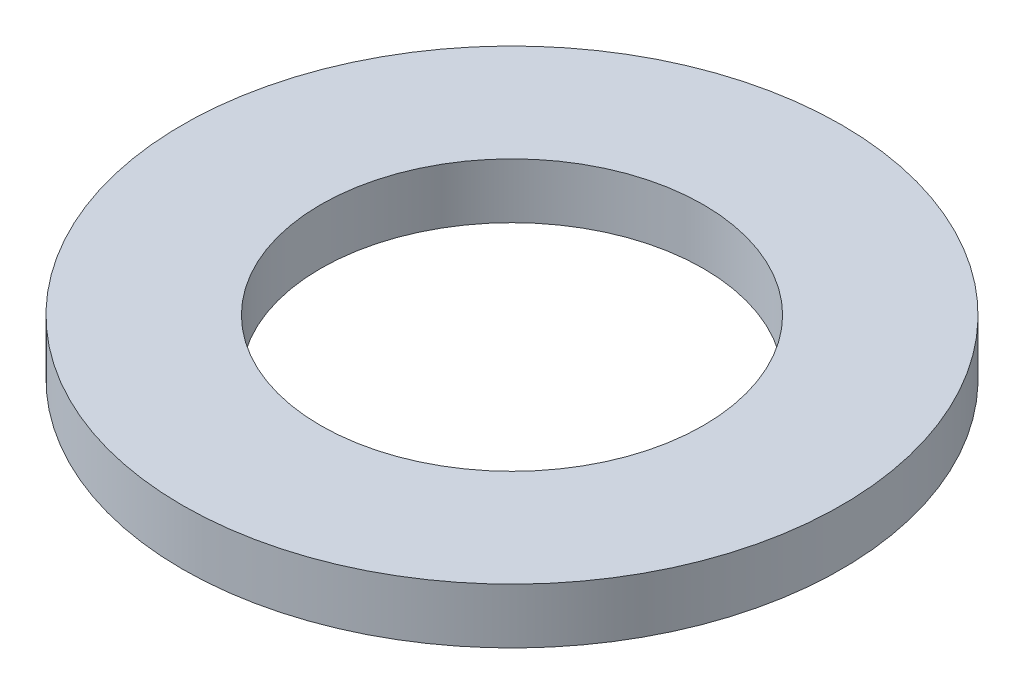
ISO-10303-21;
HEADER;
FILE_DESCRIPTION(('STEP AP214'),'2;1');
FILE_NAME('part.step','',(''),(''),'','','');
FILE_SCHEMA(('AUTOMOTIVE_DESIGN { 1 0 10303 214 1 1 1 1 }'));
ENDSEC;
DATA;
#1=APPLICATION_CONTEXT('core data for automotive mechanical design processes');
#2=APPLICATION_PROTOCOL_DEFINITION('international standard','automotive_design',2000,#1);
#3=PRODUCT_CONTEXT('',#1,'mechanical');
#4=PRODUCT('Part','Part','',(#3));
#5=PRODUCT_RELATED_PRODUCT_CATEGORY('part','',(#4));
#6=PRODUCT_DEFINITION_FORMATION('','',#4);
#7=PRODUCT_DEFINITION_CONTEXT('part definition',#1,'design');
#8=PRODUCT_DEFINITION('design','',#6,#7);
#9=PRODUCT_DEFINITION_SHAPE('','',#8);
#10=(LENGTH_UNIT() NAMED_UNIT(*) SI_UNIT(.MILLI.,.METRE.));
#11=(NAMED_UNIT(*) PLANE_ANGLE_UNIT() SI_UNIT($,.RADIAN.));
#12=(NAMED_UNIT(*) SI_UNIT($,.STERADIAN.) SOLID_ANGLE_UNIT());
#13=UNCERTAINTY_MEASURE_WITH_UNIT(LENGTH_MEASURE(1.E-05),#10,'distance_accuracy_value','');
#14=(GEOMETRIC_REPRESENTATION_CONTEXT(3) GLOBAL_UNCERTAINTY_ASSIGNED_CONTEXT((#13)) GLOBAL_UNIT_ASSIGNED_CONTEXT((#10,
#11,#12)) REPRESENTATION_CONTEXT('',''));
#15=CARTESIAN_POINT('',(0.,0.,0.));
#16=DIRECTION('',(0.,0.,1.));
#17=DIRECTION('',(1.,0.,0.));
#18=AXIS2_PLACEMENT_3D('',#15,#16,#17);
#19=CARTESIAN_POINT('',(0.,13.,0.));
#20=DIRECTION('',(0.,-1.,0.));
#21=DIRECTION('',(0.,0.,-1.));
#22=AXIS2_PLACEMENT_3D('',#19,#20,#21);
#23=CYLINDRICAL_SURFACE('',#22,77.5);
#24=CARTESIAN_POINT('',(0.,13.,0.));
#25=DIRECTION('',(0.,1.,0.));
#26=DIRECTION('',(0.,0.,1.));
#27=AXIS2_PLACEMENT_3D('',#24,#25,#26);
#28=CIRCLE('',#27,77.5);
#29=CARTESIAN_POINT('',(0.,13.,-77.5));
#30=VERTEX_POINT('',#29);
#31=EDGE_CURVE('E10',#30,#30,#28,.T.);
#32=CARTESIAN_POINT('',(0.,0.,0.));
#33=DIRECTION('',(0.,1.,0.));
#34=DIRECTION('',(0.,0.,1.));
#35=AXIS2_PLACEMENT_3D('',#32,#33,#34);
#36=CIRCLE('',#35,77.5);
#37=CARTESIAN_POINT('',(0.,0.,-77.5));
#38=VERTEX_POINT('',#37);
#39=EDGE_CURVE('E37',#38,#38,#36,.T.);
#40=CARTESIAN_POINT('',(0.,13.,-77.5));
#41=CARTESIAN_POINT('',(0.,12.8645833333333,-77.5));
#42=CARTESIAN_POINT('',(0.,12.7291666666667,-77.5));
#43=CARTESIAN_POINT('',(0.,12.4583333333333,-77.5));
#44=CARTESIAN_POINT('',(0.,12.3229166666667,-77.5));
#45=CARTESIAN_POINT('',(0.,12.0520833333333,-77.5));
#46=CARTESIAN_POINT('',(0.,11.9166666666667,-77.5));
#47=CARTESIAN_POINT('',(0.,11.6458333333333,-77.5));
#48=CARTESIAN_POINT('',(0.,11.5104166666667,-77.5));
#49=CARTESIAN_POINT('',(0.,11.2395833333333,-77.5));
#50=CARTESIAN_POINT('',(0.,11.1041666666667,-77.5));
#51=CARTESIAN_POINT('',(0.,10.8333333333333,-77.5));
#52=CARTESIAN_POINT('',(0.,10.6979166666667,-77.5));
#53=CARTESIAN_POINT('',(0.,10.4270833333333,-77.5));
#54=CARTESIAN_POINT('',(0.,10.2916666666667,-77.5));
#55=CARTESIAN_POINT('',(0.,10.0208333333333,-77.5));
#56=CARTESIAN_POINT('',(0.,9.88541666666667,-77.5));
#57=CARTESIAN_POINT('',(0.,9.61458333333333,-77.5));
#58=CARTESIAN_POINT('',(0.,9.47916666666667,-77.5));
#59=CARTESIAN_POINT('',(0.,9.20833333333333,-77.5));
#60=CARTESIAN_POINT('',(0.,9.07291666666666,-77.5));
#61=CARTESIAN_POINT('',(0.,8.80208333333333,-77.5));
#62=CARTESIAN_POINT('',(0.,8.66666666666667,-77.5));
#63=CARTESIAN_POINT('',(0.,8.39583333333333,-77.5));
#64=CARTESIAN_POINT('',(0.,8.26041666666667,-77.5));
#65=CARTESIAN_POINT('',(0.,7.98958333333333,-77.5));
#66=CARTESIAN_POINT('',(0.,7.85416666666667,-77.5));
#67=CARTESIAN_POINT('',(0.,7.58333333333333,-77.5));
#68=CARTESIAN_POINT('',(0.,7.44791666666667,-77.5));
#69=CARTESIAN_POINT('',(0.,7.17708333333333,-77.5));
#70=CARTESIAN_POINT('',(0.,7.04166666666667,-77.5));
#71=CARTESIAN_POINT('',(0.,6.77083333333333,-77.5));
#72=CARTESIAN_POINT('',(0.,6.63541666666667,-77.5));
#73=CARTESIAN_POINT('',(0.,6.36458333333333,-77.5));
#74=CARTESIAN_POINT('',(0.,6.22916666666667,-77.5));
#75=CARTESIAN_POINT('',(0.,5.95833333333333,-77.5));
#76=CARTESIAN_POINT('',(0.,5.82291666666667,-77.5));
#77=CARTESIAN_POINT('',(0.,5.55208333333333,-77.5));
#78=CARTESIAN_POINT('',(0.,5.41666666666667,-77.5));
#79=CARTESIAN_POINT('',(0.,5.14583333333333,-77.5));
#80=CARTESIAN_POINT('',(0.,5.01041666666667,-77.5));
#81=CARTESIAN_POINT('',(0.,4.73958333333333,-77.5));
#82=CARTESIAN_POINT('',(0.,4.60416666666667,-77.5));
#83=CARTESIAN_POINT('',(0.,4.33333333333333,-77.5));
#84=CARTESIAN_POINT('',(0.,4.19791666666667,-77.5));
#85=CARTESIAN_POINT('',(0.,3.92708333333333,-77.5));
#86=CARTESIAN_POINT('',(0.,3.79166666666667,-77.5));
#87=CARTESIAN_POINT('',(0.,3.52083333333333,-77.5));
#88=CARTESIAN_POINT('',(0.,3.38541666666667,-77.5));
#89=CARTESIAN_POINT('',(0.,3.11458333333333,-77.5));
#90=CARTESIAN_POINT('',(0.,2.97916666666667,-77.5));
#91=CARTESIAN_POINT('',(0.,2.70833333333333,-77.5));
#92=CARTESIAN_POINT('',(0.,2.57291666666667,-77.5));
#93=CARTESIAN_POINT('',(0.,2.30208333333333,-77.5));
#94=CARTESIAN_POINT('',(0.,2.16666666666667,-77.5));
#95=CARTESIAN_POINT('',(0.,1.89583333333333,-77.5));
#96=CARTESIAN_POINT('',(0.,1.76041666666667,-77.5));
#97=CARTESIAN_POINT('',(0.,1.48958333333333,-77.5));
#98=CARTESIAN_POINT('',(0.,1.35416666666667,-77.5));
#99=CARTESIAN_POINT('',(0.,1.08333333333333,-77.5));
#100=CARTESIAN_POINT('',(0.,0.947916666666667,-77.5));
#101=CARTESIAN_POINT('',(0.,0.677083333333334,-77.5));
#102=CARTESIAN_POINT('',(0.,0.541666666666667,-77.5));
#103=CARTESIAN_POINT('',(0.,0.270833333333334,-77.5));
#104=CARTESIAN_POINT('',(0.,0.135416666666667,-77.5));
#105=CARTESIAN_POINT('',(0.,0.,-77.5));
#106=B_SPLINE_CURVE_WITH_KNOTS('',3,(#40,#41,#42,#43,#44,#45,#46,#47,#48,#49,#50,#51,#52,#53,
#54,#55,#56,#57,#58,#59,#60,#61,#62,#63,#64,#65,#66,#67,#68,#69,#70,#71,#72,#73,#74,#75,#76,#77,
#78,#79,#80,#81,#82,#83,#84,#85,#86,#87,#88,#89,#90,#91,#92,#93,#94,#95,#96,#97,#98,#99,#100,
#101,#102,#103,#104,#105),.UNSPECIFIED.,.F.,.F.,(4,2,2,2,2,2,2,2,2,2,2,2,2,2,2,2,2,2,2,2,2,2,2,
2,2,2,2,2,2,2,2,2,4),(0.,0.40625,0.812500000000001,1.21875,1.625,2.03125,2.4375,2.84375,3.25,
3.65625,4.0625,4.46875,4.875,5.28125,5.6875,6.09375,6.5,6.90625,7.3125,7.71875,8.125,8.53125,
8.9375,9.34375,9.75,10.15625,10.5625,10.96875,11.375,11.78125,12.1875,12.59375,13.),.UNSPECIFIED.);
#107=EDGE_CURVE('BSEAM40',#30,#38,#106,.T.);
#108=ORIENTED_EDGE('',*,*,#31,.F.);
#109=ORIENTED_EDGE('',*,*,#39,.T.);
#110=ORIENTED_EDGE('',*,*,#107,.T.);
#111=ORIENTED_EDGE('',*,*,#107,.F.);
#112=EDGE_LOOP('',(#108,#110,#109,#111));
#113=FACE_BOUND('',#112,.T.);
#114=ADVANCED_FACE('F40',(#113),#23,.T.);
#115=CARTESIAN_POINT('',(0.,13.,0.));
#116=DIRECTION('',(0.,1.,0.));
#117=DIRECTION('',(0.,0.,1.));
#118=AXIS2_PLACEMENT_3D('',#115,#116,#117);
#119=PLANE('',#118);
#120=CARTESIAN_POINT('',(0.,13.,0.));
#121=DIRECTION('',(0.,1.,0.));
#122=DIRECTION('',(0.,0.,1.));
#123=AXIS2_PLACEMENT_3D('',#120,#121,#122);
#124=CIRCLE('',#123,45.);
#125=CARTESIAN_POINT('',(0.,13.,-45.));
#126=VERTEX_POINT('',#125);
#127=EDGE_CURVE('E50',#126,#126,#124,.T.);
#128=ORIENTED_EDGE('',*,*,#127,.F.);
#129=EDGE_LOOP('',(#128));
#130=FACE_BOUND('',#129,.T.);
#131=ORIENTED_EDGE('',*,*,#31,.T.);
#132=EDGE_LOOP('',(#131));
#133=FACE_BOUND('',#132,.T.);
#134=ADVANCED_FACE('F59',(#130,#133),#119,.T.);
#135=CARTESIAN_POINT('',(0.,0.,0.));
#136=DIRECTION('',(0.,1.,0.));
#137=DIRECTION('',(0.,0.,1.));
#138=AXIS2_PLACEMENT_3D('',#135,#136,#137);
#139=PLANE('',#138);
#140=CARTESIAN_POINT('',(0.,0.,0.));
#141=DIRECTION('',(0.,1.,0.));
#142=DIRECTION('',(0.,0.,1.));
#143=AXIS2_PLACEMENT_3D('',#140,#141,#142);
#144=CIRCLE('',#143,45.);
#145=CARTESIAN_POINT('',(0.,0.,-45.));
#146=VERTEX_POINT('',#145);
#147=EDGE_CURVE('E47',#146,#146,#144,.T.);
#148=ORIENTED_EDGE('',*,*,#147,.T.);
#149=EDGE_LOOP('',(#148));
#150=FACE_BOUND('',#149,.T.);
#151=ORIENTED_EDGE('',*,*,#39,.F.);
#152=EDGE_LOOP('',(#151));
#153=FACE_BOUND('',#152,.T.);
#154=ADVANCED_FACE('F58',(#150,#153),#139,.F.);
#155=CARTESIAN_POINT('',(0.,13.,0.));
#156=DIRECTION('',(0.,-1.,0.));
#157=DIRECTION('',(0.,0.,-1.));
#158=AXIS2_PLACEMENT_3D('',#155,#156,#157);
#159=CYLINDRICAL_SURFACE('',#158,45.);
#160=CARTESIAN_POINT('',(0.,13.,-45.));
#161=CARTESIAN_POINT('',(0.,12.8645833333333,-45.));
#162=CARTESIAN_POINT('',(0.,12.7291666666667,-45.));
#163=CARTESIAN_POINT('',(0.,12.4583333333333,-45.));
#164=CARTESIAN_POINT('',(0.,12.3229166666667,-45.));
#165=CARTESIAN_POINT('',(0.,12.0520833333333,-45.));
#166=CARTESIAN_POINT('',(0.,11.9166666666667,-45.));
#167=CARTESIAN_POINT('',(0.,11.6458333333333,-45.));
#168=CARTESIAN_POINT('',(0.,11.5104166666667,-45.));
#169=CARTESIAN_POINT('',(0.,11.2395833333333,-45.));
#170=CARTESIAN_POINT('',(0.,11.1041666666667,-45.));
#171=CARTESIAN_POINT('',(0.,10.8333333333333,-45.));
#172=CARTESIAN_POINT('',(0.,10.6979166666667,-45.));
#173=CARTESIAN_POINT('',(0.,10.4270833333333,-45.));
#174=CARTESIAN_POINT('',(0.,10.2916666666667,-45.));
#175=CARTESIAN_POINT('',(0.,10.0208333333333,-45.));
#176=CARTESIAN_POINT('',(0.,9.88541666666667,-45.));
#177=CARTESIAN_POINT('',(0.,9.61458333333333,-45.));
#178=CARTESIAN_POINT('',(0.,9.47916666666667,-45.));
#179=CARTESIAN_POINT('',(0.,9.20833333333333,-45.));
#180=CARTESIAN_POINT('',(0.,9.07291666666666,-45.));
#181=CARTESIAN_POINT('',(0.,8.80208333333333,-45.));
#182=CARTESIAN_POINT('',(0.,8.66666666666667,-45.));
#183=CARTESIAN_POINT('',(0.,8.39583333333333,-45.));
#184=CARTESIAN_POINT('',(0.,8.26041666666667,-45.));
#185=CARTESIAN_POINT('',(0.,7.98958333333333,-45.));
#186=CARTESIAN_POINT('',(0.,7.85416666666667,-45.));
#187=CARTESIAN_POINT('',(0.,7.58333333333333,-45.));
#188=CARTESIAN_POINT('',(0.,7.44791666666667,-45.));
#189=CARTESIAN_POINT('',(0.,7.17708333333333,-45.));
#190=CARTESIAN_POINT('',(0.,7.04166666666667,-45.));
#191=CARTESIAN_POINT('',(0.,6.77083333333333,-45.));
#192=CARTESIAN_POINT('',(0.,6.63541666666667,-45.));
#193=CARTESIAN_POINT('',(0.,6.36458333333333,-45.));
#194=CARTESIAN_POINT('',(0.,6.22916666666667,-45.));
#195=CARTESIAN_POINT('',(0.,5.95833333333333,-45.));
#196=CARTESIAN_POINT('',(0.,5.82291666666667,-45.));
#197=CARTESIAN_POINT('',(0.,5.55208333333333,-45.));
#198=CARTESIAN_POINT('',(0.,5.41666666666667,-45.));
#199=CARTESIAN_POINT('',(0.,5.14583333333333,-45.));
#200=CARTESIAN_POINT('',(0.,5.01041666666667,-45.));
#201=CARTESIAN_POINT('',(0.,4.73958333333333,-45.));
#202=CARTESIAN_POINT('',(0.,4.60416666666667,-45.));
#203=CARTESIAN_POINT('',(0.,4.33333333333333,-45.));
#204=CARTESIAN_POINT('',(0.,4.19791666666667,-45.));
#205=CARTESIAN_POINT('',(0.,3.92708333333333,-45.));
#206=CARTESIAN_POINT('',(0.,3.79166666666667,-45.));
#207=CARTESIAN_POINT('',(0.,3.52083333333333,-45.));
#208=CARTESIAN_POINT('',(0.,3.38541666666667,-45.));
#209=CARTESIAN_POINT('',(0.,3.11458333333333,-45.));
#210=CARTESIAN_POINT('',(0.,2.97916666666667,-45.));
#211=CARTESIAN_POINT('',(0.,2.70833333333333,-45.));
#212=CARTESIAN_POINT('',(0.,2.57291666666667,-45.));
#213=CARTESIAN_POINT('',(0.,2.30208333333333,-45.));
#214=CARTESIAN_POINT('',(0.,2.16666666666667,-45.));
#215=CARTESIAN_POINT('',(0.,1.89583333333333,-45.));
#216=CARTESIAN_POINT('',(0.,1.76041666666667,-45.));
#217=CARTESIAN_POINT('',(0.,1.48958333333333,-45.));
#218=CARTESIAN_POINT('',(0.,1.35416666666667,-45.));
#219=CARTESIAN_POINT('',(0.,1.08333333333333,-45.));
#220=CARTESIAN_POINT('',(0.,0.947916666666667,-45.));
#221=CARTESIAN_POINT('',(0.,0.677083333333334,-45.));
#222=CARTESIAN_POINT('',(0.,0.541666666666667,-45.));
#223=CARTESIAN_POINT('',(0.,0.270833333333334,-45.));
#224=CARTESIAN_POINT('',(0.,0.135416666666667,-45.));
#225=CARTESIAN_POINT('',(0.,0.,-45.));
#226=B_SPLINE_CURVE_WITH_KNOTS('',3,(#160,#161,#162,#163,#164,#165,#166,#167,#168,#169,#170,
#171,#172,#173,#174,#175,#176,#177,#178,#179,#180,#181,#182,#183,#184,#185,#186,#187,#188,#189,
#190,#191,#192,#193,#194,#195,#196,#197,#198,#199,#200,#201,#202,#203,#204,#205,#206,#207,#208,
#209,#210,#211,#212,#213,#214,#215,#216,#217,#218,#219,#220,#221,#222,#223,#224,#225),
.UNSPECIFIED.,.F.,.F.,(4,2,2,2,2,2,2,2,2,2,2,2,2,2,2,2,2,2,2,2,2,2,2,2,2,2,2,2,2,2,2,2,4),(0.,
0.40625,0.812500000000001,1.21875,1.625,2.03125,2.4375,2.84375,3.25,3.65625,4.0625,4.46875,
4.875,5.28125,5.6875,6.09375,6.5,6.90625,7.3125,7.71875,8.125,8.53125,8.9375,9.34375,9.75,
10.15625,10.5625,10.96875,11.375,11.78125,12.1875,12.59375,13.),.UNSPECIFIED.);
#227=EDGE_CURVE('BSEAM54',#126,#146,#226,.T.);
#228=ORIENTED_EDGE('',*,*,#127,.T.);
#229=ORIENTED_EDGE('',*,*,#147,.F.);
#230=ORIENTED_EDGE('',*,*,#227,.T.);
#231=ORIENTED_EDGE('',*,*,#227,.F.);
#232=EDGE_LOOP('',(#228,#230,#229,#231));
#233=FACE_BOUND('',#232,.T.);
#234=ADVANCED_FACE('F54',(#233),#159,.F.);
#235=CLOSED_SHELL('',(#114,#134,#154,#234));
#236=MANIFOLD_SOLID_BREP('B2',#235);
#237=ADVANCED_BREP_SHAPE_REPRESENTATION('',(#18,#236),#14);
#238=SHAPE_DEFINITION_REPRESENTATION(#9,#237);
ENDSEC;
END-ISO-10303-21;
